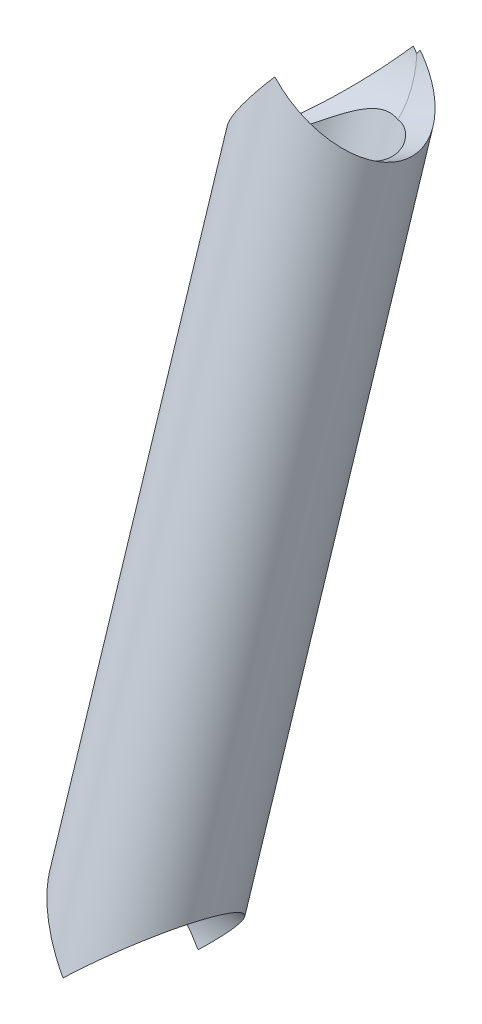
ISO-10303-21;
HEADER;
FILE_DESCRIPTION(('STEP AP214'),'2;1');
FILE_NAME('part.step','',(''),(''),'','','');
FILE_SCHEMA(('AUTOMOTIVE_DESIGN { 1 0 10303 214 1 1 1 1 }'));
ENDSEC;
DATA;
#1=APPLICATION_CONTEXT('core data for automotive mechanical design processes');
#2=APPLICATION_PROTOCOL_DEFINITION('international standard','automotive_design',2000,#1);
#3=PRODUCT_CONTEXT('',#1,'mechanical');
#4=PRODUCT('Part','Part','',(#3));
#5=PRODUCT_RELATED_PRODUCT_CATEGORY('part','',(#4));
#6=PRODUCT_DEFINITION_FORMATION('','',#4);
#7=PRODUCT_DEFINITION_CONTEXT('part definition',#1,'design');
#8=PRODUCT_DEFINITION('design','',#6,#7);
#9=PRODUCT_DEFINITION_SHAPE('','',#8);
#10=(LENGTH_UNIT() NAMED_UNIT(*) SI_UNIT(.MILLI.,.METRE.));
#11=(NAMED_UNIT(*) PLANE_ANGLE_UNIT() SI_UNIT($,.RADIAN.));
#12=(NAMED_UNIT(*) SI_UNIT($,.STERADIAN.) SOLID_ANGLE_UNIT());
#13=UNCERTAINTY_MEASURE_WITH_UNIT(LENGTH_MEASURE(1.E-05),#10,'distance_accuracy_value','');
#14=(GEOMETRIC_REPRESENTATION_CONTEXT(3) GLOBAL_UNCERTAINTY_ASSIGNED_CONTEXT((#13)) GLOBAL_UNIT_ASSIGNED_CONTEXT((#10,
#11,#12)) REPRESENTATION_CONTEXT('',''));
#15=CARTESIAN_POINT('',(0.,0.,0.));
#16=DIRECTION('',(0.,0.,1.));
#17=DIRECTION('',(1.,0.,0.));
#18=AXIS2_PLACEMENT_3D('',#15,#16,#17);
#19=CARTESIAN_POINT('',(549.763263321792,0.,-200.000000000003));
#20=DIRECTION('',(0.,0.952725352528927,-0.303832853142369));
#21=DIRECTION('',(0.,0.303832853142369,0.952725352528927));
#22=AXIS2_PLACEMENT_3D('',#19,#20,#21);
#23=CYLINDRICAL_SURFACE('',#22,9.65000000000002);
#24=CARTESIAN_POINT('',(548.720894557651,115.317466106993,-226.706224291465));
#25=CARTESIAN_POINT('',(548.904218856141,115.400067795765,-226.711627767979));
#26=CARTESIAN_POINT('',(549.090716723595,115.475636342496,-226.720070470305));
#27=CARTESIAN_POINT('',(549.468858186625,115.611517807793,-226.743508663642));
#28=CARTESIAN_POINT('',(549.660503754448,115.671824784224,-226.758506700813));
#29=CARTESIAN_POINT('',(550.045923532026,115.775478212561,-226.795366608986));
#30=CARTESIAN_POINT('',(550.239665074277,115.818966613044,-226.817168096451));
#31=CARTESIAN_POINT('',(550.629148648254,115.889257505975,-226.868087930455));
#32=CARTESIAN_POINT('',(550.824890154707,115.916064270745,-226.897204400876));
#33=CARTESIAN_POINT('',(551.21710952155,115.953286044602,-226.963182381835));
#34=CARTESIAN_POINT('',(551.413588014036,115.96366095575,-227.000062590444));
#35=CARTESIAN_POINT('',(551.805088275734,115.968795082221,-227.081789210122));
#36=CARTESIAN_POINT('',(552.000109849862,115.963552242583,-227.12663666878));
#37=CARTESIAN_POINT('',(552.387470210609,115.938807438365,-227.224553708154));
#38=CARTESIAN_POINT('',(552.579804178785,115.919282557546,-227.277636394718));
#39=CARTESIAN_POINT('',(552.960273802841,115.867597275244,-227.39209938375));
#40=CARTESIAN_POINT('',(553.148408388739,115.83543369146,-227.453481773446));
#41=CARTESIAN_POINT('',(553.571181873634,115.749718659436,-227.602890159303));
#42=CARTESIAN_POINT('',(553.804183298553,115.692705562643,-227.693575859938));
#43=CARTESIAN_POINT('',(554.260243674154,115.564322014848,-227.888750156296));
#44=CARTESIAN_POINT('',(554.483299816071,115.492947538863,-227.993242618739));
#45=CARTESIAN_POINT('',(554.918585934714,115.338886376735,-228.216196016558));
#46=CARTESIAN_POINT('',(555.130802757188,115.25618637405,-228.334673372373));
#47=CARTESIAN_POINT('',(555.543187163795,115.082289555155,-228.585474761989));
#48=CARTESIAN_POINT('',(555.743355608304,114.991093346847,-228.717797805216));
#49=CARTESIAN_POINT('',(556.133860803505,114.801097441472,-228.998404793694));
#50=CARTESIAN_POINT('',(556.323993514547,114.702200747913,-229.146906959589));
#51=CARTESIAN_POINT('',(556.690076463765,114.500276761813,-229.457925538267));
#52=CARTESIAN_POINT('',(556.866026603345,114.397249440563,-229.62044204846));
#53=CARTESIAN_POINT('',(557.202731235622,114.189052527578,-229.959077057864));
#54=CARTESIAN_POINT('',(557.363493327626,114.083884039534,-230.135188673778));
#55=CARTESIAN_POINT('',(557.668960352611,113.873094393251,-230.500593727241));
#56=CARTESIAN_POINT('',(557.813664698912,113.767473218619,-230.689887646002));
#57=CARTESIAN_POINT('',(558.095834337163,113.549803683165,-231.095050413982));
#58=CARTESIAN_POINT('',(558.232030306234,113.437839468452,-231.311851407108));
#59=CARTESIAN_POINT('',(558.483653477465,113.216994628302,-231.758703968249));
#60=CARTESIAN_POINT('',(558.599079547547,113.108114171219,-231.988756257634));
#61=CARTESIAN_POINT('',(558.808040531037,112.895058087504,-232.460658122718));
#62=CARTESIAN_POINT('',(558.901577837694,112.790881947523,-232.702506405183));
#63=CARTESIAN_POINT('',(559.065816052654,112.588644333667,-233.196296752561));
#64=CARTESIAN_POINT('',(559.136518730024,112.490582386583,-233.448238033839));
#65=CARTESIAN_POINT('',(559.250544968897,112.30787524579,-233.943671601414));
#66=CARTESIAN_POINT('',(559.295343258697,112.222772513669,-234.186656859003));
#67=CARTESIAN_POINT('',(559.363929897506,112.059742319891,-234.67793669536));
#68=CARTESIAN_POINT('',(559.387719146475,111.981814551009,-234.926231046236));
#69=CARTESIAN_POINT('',(559.414114512161,111.833717927697,-235.426185149803));
#70=CARTESIAN_POINT('',(559.416724266355,111.763547742981,-235.677844317164));
#71=CARTESIAN_POINT('',(559.400825326342,111.631292976862,-236.182611305406));
#72=CARTESIAN_POINT('',(559.382316738599,111.569208354699,-236.435719118978));
#73=CARTESIAN_POINT('',(559.325356742906,111.455045282838,-236.933494337542));
#74=CARTESIAN_POINT('',(559.28754781019,111.402714425266,-237.178177913705));
#75=CARTESIAN_POINT('',(559.192774110657,111.305614703238,-237.665310532685));
#76=CARTESIAN_POINT('',(559.135809895518,111.260845621058,-237.907759639649));
#77=CARTESIAN_POINT('',(559.003263835808,111.178539653446,-238.388725202246));
#78=CARTESIAN_POINT('',(558.927684031316,111.14100197633,-238.627242085756));
#79=CARTESIAN_POINT('',(558.758519040256,111.072609749441,-239.098783515483));
#80=CARTESIAN_POINT('',(558.664933131486,111.041755467838,-239.331807840978));
#81=CARTESIAN_POINT('',(558.455710696084,110.984700180769,-239.801413966584));
#82=CARTESIAN_POINT('',(558.339257614994,110.958778655176,-240.037665993259));
#83=CARTESIAN_POINT('',(558.088150198072,110.912329378819,-240.500841660434));
#84=CARTESIAN_POINT('',(557.953495244523,110.89180181118,-240.727764984004));
#85=CARTESIAN_POINT('',(557.66649340616,110.854736713348,-241.171047068993));
#86=CARTESIAN_POINT('',(557.514115809989,110.838206267004,-241.387386540024));
#87=CARTESIAN_POINT('',(557.192599897249,110.80750501869,-241.807418471113));
#88=CARTESIAN_POINT('',(557.023461153897,110.793334276829,-242.011110608921));
#89=CARTESIAN_POINT('',(556.65812244567,110.764470297927,-242.416334485832));
#90=CARTESIAN_POINT('',(556.460893460215,110.749799423836,-242.616942957495));
#91=CARTESIAN_POINT('',(556.049263376281,110.717969469392,-242.999627429385));
#92=CARTESIAN_POINT('',(555.834858784316,110.700809882262,-243.181699642183));
#93=CARTESIAN_POINT('',(555.390851937206,110.660687206243,-243.524069266201));
#94=CARTESIAN_POINT('',(555.161300402914,110.637742826025,-243.684434359047));
#95=CARTESIAN_POINT('',(554.68824398864,110.582270506854,-243.981044407543));
#96=CARTESIAN_POINT('',(554.44474843815,110.549748916727,-244.117305246656));
#97=CARTESIAN_POINT('',(554.026997687505,110.484010003277,-244.323081997036));
#98=CARTESIAN_POINT('',(553.855766292114,110.454406597092,-244.399944236016));
#99=CARTESIAN_POINT('',(553.509312661071,110.388042799328,-244.540397952941));
#100=CARTESIAN_POINT('',(553.334091540256,110.351284385896,-244.603993088803));
#101=CARTESIAN_POINT('',(552.981106435739,110.269837826712,-244.717234218293));
#102=CARTESIAN_POINT('',(552.803344007572,110.22515435563,-244.766888390772));
#103=CARTESIAN_POINT('',(552.446769519872,110.127448223914,-244.851951683149));
#104=CARTESIAN_POINT('',(552.267957694131,110.07442735757,-244.887363862247));
#105=CARTESIAN_POINT('',(551.854730039719,109.942060862894,-244.952867054076));
#106=CARTESIAN_POINT('',(551.620441986809,109.859671670836,-244.977816508592));
#107=CARTESIAN_POINT('',(551.271994032701,109.726119582195,-244.997711548328));
#108=CARTESIAN_POINT('',(551.15631238937,109.679927532934,-245.00142038812));
#109=CARTESIAN_POINT('',(550.926190339932,109.584447951588,-245.003241315008));
#110=CARTESIAN_POINT('',(550.811749898647,109.535160507506,-245.001353561144));
#111=CARTESIAN_POINT('',(550.698039428663,109.484435551709,-244.996794368462));
#112=B_SPLINE_CURVE_WITH_KNOTS('',3,(#24,#25,#26,#27,#28,#29,#30,#31,#32,#33,#34,#35,#36,#37,
#38,#39,#40,#41,#42,#43,#44,#45,#46,#47,#48,#49,#50,#51,#52,#53,#54,#55,#56,#57,#58,#59,#60,#61,
#62,#63,#64,#65,#66,#67,#68,#69,#70,#71,#72,#73,#74,#75,#76,#77,#78,#79,#80,#81,#82,#83,#84,#85,
#86,#87,#88,#89,#90,#91,#92,#93,#94,#95,#96,#97,#98,#99,#100,#101,#102,#103,#104,#105,#106,#107,
#108,#109,#110,#111),.UNSPECIFIED.,.F.,.F.,(4,2,2,2,2,2,2,2,2,2,2,2,2,2,2,2,2,2,2,2,2,2,2,2,2,2,
2,2,2,2,2,2,2,2,2,2,2,2,2,2,2,2,2,4),(0.,0.603401911009862,1.2070383980778,1.8054628204255,
2.40373391754963,3.0034627125778,3.60327042257874,4.20404267070272,4.80496628437951,
5.57321395701334,6.34167724277562,7.11105197133343,7.88037169345789,8.6617860814401,
9.44320590124445,10.2242326454028,11.0052879154717,11.8425224944076,12.6798026935905,
13.5169913043677,14.3541150400883,15.1371105115044,15.9200724402839,16.7028998962531,
17.4857234057298,18.2440396320007,19.0023340204597,19.7605453445101,20.5187870857545,
21.3119222678832,22.1050843734456,22.8996420142944,23.6942198918684,24.5382447312516,
25.3824416817,26.2239426625357,27.0648870550076,27.6343517263143,28.2036591805511,
28.7726319335983,29.3414824051641,30.088522450766,30.4622367941762,30.8359405176496),.UNSPECIFIED.);
#113=CARTESIAN_POINT('',(552.000788998512,115.961111324297,-227.128263209481));
#114=VERTEX_POINT('',#113);
#115=CARTESIAN_POINT('',(552.9506630298,110.261122917529,-244.723648048153));
#116=VERTEX_POINT('',#115);
#117=EDGE_CURVE('E121',#114,#116,#112,.T.);
#118=ORIENTED_EDGE('',*,*,#117,.T.);
#119=CARTESIAN_POINT('',(549.763263321791,115.839837306432,-226.813549370293));
#120=CARTESIAN_POINT('',(549.963454600101,115.883889960353,-226.827598901403));
#121=CARTESIAN_POINT('',(550.165307901029,115.919265125789,-226.84543045096));
#122=CARTESIAN_POINT('',(550.570552825057,115.971769590148,-226.888880425677));
#123=CARTESIAN_POINT('',(550.773944438699,115.98889900116,-226.914498802998));
#124=CARTESIAN_POINT('',(551.180423033905,116.00487762994,-226.973691346003));
#125=CARTESIAN_POINT('',(551.383509708001,116.003714212572,-227.007270994889));
#126=CARTESIAN_POINT('',(551.78731677027,115.983894969948,-227.082446634744));
#127=CARTESIAN_POINT('',(551.988036999281,115.965237974828,-227.124043161686));
#128=CARTESIAN_POINT('',(552.383703703848,115.912155124445,-227.21486570198));
#129=CARTESIAN_POINT('',(552.578685512267,115.87786996689,-227.264021101649));
#130=CARTESIAN_POINT('',(552.963528778639,115.795400300772,-227.370218956944));
#131=CARTESIAN_POINT('',(553.15338755417,115.747208659481,-227.427265452128));
#132=CARTESIAN_POINT('',(553.714229729974,115.584613583957,-227.610371328329));
#133=CARTESIAN_POINT('',(554.076285238991,115.452219450728,-227.748353108137));
#134=CARTESIAN_POINT('',(554.666278688279,115.199606309753,-228.009317599273));
#135=CARTESIAN_POINT('',(554.901654910871,115.087820768964,-228.1242097691));
#136=CARTESIAN_POINT('',(555.358004067128,114.852278060427,-228.369614330178));
#137=CARTESIAN_POINT('',(555.578972330569,114.728517042898,-228.50013174773));
#138=CARTESIAN_POINT('',(556.005820845145,114.472536937547,-228.776987879255));
#139=CARTESIAN_POINT('',(556.211689075403,114.340311264658,-228.923338973612));
#140=CARTESIAN_POINT('',(556.607410978176,114.070538262874,-229.231883038767));
#141=CARTESIAN_POINT('',(556.797266232798,113.932991461678,-229.394074441094));
#142=CARTESIAN_POINT('',(557.161993188241,113.653789514853,-229.736107487884));
#143=CARTESIAN_POINT('',(557.33668667909,113.512106399287,-229.91611654158));
#144=CARTESIAN_POINT('',(557.667738161876,113.228549336517,-230.292173448894));
#145=CARTESIAN_POINT('',(557.824095656841,113.086675384246,-230.48822173699));
#146=CARTESIAN_POINT('',(558.117116334748,112.805196429755,-230.895796762118));
#147=CARTESIAN_POINT('',(558.253793105133,112.665589921759,-231.107312666809));
#148=CARTESIAN_POINT('',(558.506224741362,112.390795583312,-231.545198054997));
#149=CARTESIAN_POINT('',(558.621980840241,112.25560749283,-231.771566662022));
#150=CARTESIAN_POINT('',(558.828082916248,111.995733241854,-232.231065121709));
#151=CARTESIAN_POINT('',(558.919084636022,111.870854002945,-232.463791022093));
#152=CARTESIAN_POINT('',(559.078946387723,111.629113028953,-232.940756918349));
#153=CARTESIAN_POINT('',(559.147806588627,111.512251232689,-233.184996826332));
#154=CARTESIAN_POINT('',(559.262355117917,111.288305109391,-233.68302337019));
#155=CARTESIAN_POINT('',(559.308057990582,111.181214680059,-233.936803906072));
#156=CARTESIAN_POINT('',(559.375637075683,110.978193805091,-234.451880738061));
#157=CARTESIAN_POINT('',(559.397516112612,110.882262037719,-234.713176139454));
#158=CARTESIAN_POINT('',(559.415953366757,110.713251402332,-235.209843955839));
#159=CARTESIAN_POINT('',(559.415182232548,110.638811816022,-235.444659168691));
#160=CARTESIAN_POINT('',(559.394828533205,110.500075319563,-235.916444055124));
#161=CARTESIAN_POINT('',(559.375247702843,110.435777474702,-236.153413528025));
#162=CARTESIAN_POINT('',(559.317527538015,110.317646380224,-236.627669572427));
#163=CARTESIAN_POINT('',(559.279389686439,110.263812294931,-236.86495611708));
#164=CARTESIAN_POINT('',(559.185022271189,110.166672340728,-237.338077744273));
#165=CARTESIAN_POINT('',(559.128792367891,110.123366669486,-237.573912799482));
#166=CARTESIAN_POINT('',(559.000371600792,110.047988673896,-238.037058102751));
#167=CARTESIAN_POINT('',(558.928574897406,110.015682231711,-238.264439996486));
#168=CARTESIAN_POINT('',(558.769042116874,109.960599330567,-238.714701417271));
#169=CARTESIAN_POINT('',(558.681306482388,109.937822607004,-238.937581069169));
#170=CARTESIAN_POINT('',(558.490685437883,109.901255503708,-239.37748153717));
#171=CARTESIAN_POINT('',(558.387801531829,109.88746423261,-239.594502932371));
#172=CARTESIAN_POINT('',(558.167668513581,109.868157279481,-240.021525279686));
#173=CARTESIAN_POINT('',(558.050417781108,109.862642531801,-240.231525436545));
#174=CARTESIAN_POINT('',(557.791350551531,109.858884508637,-240.661638606254));
#175=CARTESIAN_POINT('',(557.648278285844,109.861328028067,-240.88100158135));
#176=CARTESIAN_POINT('',(557.346974508564,109.873745772368,-241.308827171311));
#177=CARTESIAN_POINT('',(557.188742149097,109.883720418654,-241.517289175497));
#178=CARTESIAN_POINT('',(556.857648324523,109.909760188047,-241.922474940223));
#179=CARTESIAN_POINT('',(556.68476089202,109.925836305296,-242.11917676529));
#180=CARTESIAN_POINT('',(556.325318993715,109.962395672578,-242.499227581227));
#181=CARTESIAN_POINT('',(556.138764223731,109.982879020718,-242.682576274726));
#182=CARTESIAN_POINT('',(555.730287647053,110.028840266535,-243.054975455856));
#183=CARTESIAN_POINT('',(555.506768715833,110.054621750049,-243.242242952612));
#184=CARTESIAN_POINT('',(555.044138173576,110.10617290857,-243.596613158348));
#185=CARTESIAN_POINT('',(554.805022261514,110.13194257833,-243.76371026862));
#186=CARTESIAN_POINT('',(554.312644914729,110.179727479908,-244.074886662474));
#187=CARTESIAN_POINT('',(554.059418715353,110.201751552286,-244.219020093842));
#188=CARTESIAN_POINT('',(553.539565934703,110.237859946411,-244.481774207648));
#189=CARTESIAN_POINT('',(553.272949122395,110.251949967284,-244.600413165096));
#190=CARTESIAN_POINT('',(552.82475545525,110.264807637222,-244.772051292517));
#191=CARTESIAN_POINT('',(552.646463192947,110.267232533807,-244.833423586529));
#192=CARTESIAN_POINT('',(552.286004325276,110.265613195542,-244.943296749823));
#193=CARTESIAN_POINT('',(552.103838996274,110.261571060265,-244.991801790602));
#194=CARTESIAN_POINT('',(551.737025438188,110.245952371541,-245.075115121048));
#195=CARTESIAN_POINT('',(551.552381914303,110.234388535555,-245.109946370834));
#196=CARTESIAN_POINT('',(551.18166738084,110.202944342803,-245.165497182829));
#197=CARTESIAN_POINT('',(550.995596353771,110.183063883977,-245.186216571854));
#198=CARTESIAN_POINT('',(550.623061856764,110.134534420129,-245.213388123659));
#199=CARTESIAN_POINT('',(550.436598614484,110.105862900213,-245.219803298646));
#200=CARTESIAN_POINT('',(550.06527837995,110.039850593487,-245.21847354642));
#201=CARTESIAN_POINT('',(549.880421369629,110.00250990431,-245.210728778672));
#202=CARTESIAN_POINT('',(549.513439215619,109.919639504578,-245.181657574523));
#203=CARTESIAN_POINT('',(549.331317298807,109.874100836067,-245.160316215667));
#204=CARTESIAN_POINT('',(548.971006729789,109.77572427649,-245.104908695374));
#205=CARTESIAN_POINT('',(548.792819228332,109.722884281873,-245.07083886196));
#206=CARTESIAN_POINT('',(548.379848438895,109.591483199184,-244.977075792995));
#207=CARTESIAN_POINT('',(548.14696030223,109.510372153257,-244.912591288417));
#208=CARTESIAN_POINT('',(547.690474654815,109.339615080569,-244.764837874695));
#209=CARTESIAN_POINT('',(547.466880860141,109.249965686255,-244.681561536113));
#210=CARTESIAN_POINT('',(547.028522828362,109.06454792148,-244.498210144745));
#211=CARTESIAN_POINT('',(546.813785620312,108.968762813103,-244.398087813407));
#212=CARTESIAN_POINT('',(546.393587795437,108.77368362757,-244.1830438484));
#213=CARTESIAN_POINT('',(546.188127232082,108.674389530193,-244.068122129443));
#214=CARTESIAN_POINT('',(545.690426062327,108.426762375357,-243.767024950499));
#215=CARTESIAN_POINT('',(545.40337636696,108.277561769773,-243.572952213934));
#216=CARTESIAN_POINT('',(544.84736330793,107.981518243479,-243.158696408367));
#217=CARTESIAN_POINT('',(544.578409130547,107.83467654865,-242.938500232079));
#218=CARTESIAN_POINT('',(544.058219571467,107.548184497985,-242.4739774467));
#219=CARTESIAN_POINT('',(543.806979909308,107.408532407099,-242.229656701457));
#220=CARTESIAN_POINT('',(543.322465974214,107.140843347098,-241.718061468082));
#221=CARTESIAN_POINT('',(543.08918423473,107.012801546669,-241.450796618495));
#222=CARTESIAN_POINT('',(542.693159774843,106.800361943329,-240.958166958416));
#223=CARTESIAN_POINT('',(542.526539305417,106.712701765123,-240.737315833079));
#224=CARTESIAN_POINT('',(542.205438016534,106.548983165198,-240.282790322052));
#225=CARTESIAN_POINT('',(542.050957207785,106.472924753714,-240.04911592505));
#226=CARTESIAN_POINT('',(541.755654889494,106.334814284679,-239.569893178909));
#227=CARTESIAN_POINT('',(541.614809450214,106.272737426108,-239.324366808193));
#228=CARTESIAN_POINT('',(541.348105636227,106.16485177385,-238.821889310708));
#229=CARTESIAN_POINT('',(541.222241438682,106.119036645817,-238.564942676396));
#230=CARTESIAN_POINT('',(541.015760298077,106.054967790516,-238.104095826185));
#231=CARTESIAN_POINT('',(540.931552718788,106.032731468081,-237.902351808023));
#232=CARTESIAN_POINT('',(540.773866289387,106.000169570103,-237.493865819135));
#233=CARTESIAN_POINT('',(540.700381304538,105.98983716043,-237.287126785765));
#234=CARTESIAN_POINT('',(540.565117055795,105.982106166717,-236.869635283107));
#235=CARTESIAN_POINT('',(540.503335380578,105.984704915354,-236.658883650436));
#236=CARTESIAN_POINT('',(540.392467147529,106.003738286721,-236.234649929569));
#237=CARTESIAN_POINT('',(540.343380721978,106.020173053609,-236.021167812946));
#238=CARTESIAN_POINT('',(540.258482834334,106.067758517971,-235.591329679495));
#239=CARTESIAN_POINT('',(540.222783944749,106.099029209038,-235.374964469994));
#240=CARTESIAN_POINT('',(540.166002506341,106.176704442977,-234.943013655888));
#241=CARTESIAN_POINT('',(540.14491990515,106.223108931627,-234.727428048493));
#242=CARTESIAN_POINT('',(540.117866654352,106.330987923525,-234.299204337146));
#243=CARTESIAN_POINT('',(540.111888466099,106.392454892245,-234.086564815522));
#244=CARTESIAN_POINT('',(540.115168413286,106.529994387398,-233.66619602716));
#245=CARTESIAN_POINT('',(540.124425184089,106.606065605151,-233.458466322327));
#246=CARTESIAN_POINT('',(540.155876129219,106.761682974538,-233.075033272105));
#247=CARTESIAN_POINT('',(540.176334833759,106.839644809719,-232.898538611375));
#248=CARTESIAN_POINT('',(540.228430356501,107.005322575432,-232.551816412019));
#249=CARTESIAN_POINT('',(540.260071275487,107.093042076236,-232.381591197871));
#250=CARTESIAN_POINT('',(540.33401280702,107.277264266507,-232.048372152904));
#251=CARTESIAN_POINT('',(540.376313758546,107.373767235219,-231.885378552237));
#252=CARTESIAN_POINT('',(540.470948023296,107.574539435634,-231.567264084298));
#253=CARTESIAN_POINT('',(540.52328343646,107.678810290147,-231.412144873531));
#254=CARTESIAN_POINT('',(540.654223571682,107.926017339516,-231.065438233975));
#255=CARTESIAN_POINT('',(540.736015832671,108.07124924089,-230.876679365451));
#256=CARTESIAN_POINT('',(540.913767351945,108.370772657738,-230.513657739932));
#257=CARTESIAN_POINT('',(541.009730174824,108.525066446825,-230.339398647637));
#258=CARTESIAN_POINT('',(541.316961370929,108.998881749874,-229.838018875786));
#259=CARTESIAN_POINT('',(541.547484400737,109.329172448065,-229.53252050527));
#260=CARTESIAN_POINT('',(541.970244419687,109.896996021477,-229.0648599527));
#261=CARTESIAN_POINT('',(542.151611865376,110.130914106451,-228.887885726399));
#262=CARTESIAN_POINT('',(542.531680084086,110.601944055406,-228.558091704291));
#263=CARTESIAN_POINT('',(542.730387632223,110.839057136861,-228.405281415973));
#264=CARTESIAN_POINT('',(543.144092194266,111.313663761727,-228.122050055522));
#265=CARTESIAN_POINT('',(543.359131232113,111.551156633658,-227.991689772175));
#266=CARTESIAN_POINT('',(543.804211273162,112.022745112708,-227.752374659736));
#267=CARTESIAN_POINT('',(544.034250127506,112.256841200597,-227.643416773496));
#268=CARTESIAN_POINT('',(544.516198841489,112.725230465522,-227.442699392178));
#269=CARTESIAN_POINT('',(544.768554530637,112.959324373092,-227.351544429995));
#270=CARTESIAN_POINT('',(545.28948826406,113.416459094705,-227.189480823447));
#271=CARTESIAN_POINT('',(545.558072199017,113.639495840981,-227.118579585112));
#272=CARTESIAN_POINT('',(546.111342556937,114.06857947729,-226.996624932811));
#273=CARTESIAN_POINT('',(546.395969488808,114.274682964221,-226.945503089807));
#274=CARTESIAN_POINT('',(546.982858672243,114.663981505232,-226.862652822574));
#275=CARTESIAN_POINT('',(547.28510327782,114.847198922968,-226.830905346441));
#276=CARTESIAN_POINT('',(547.937928888575,115.198509593399,-226.785104801782));
#277=CARTESIAN_POINT('',(548.290374491198,115.363514697195,-226.773018185146));
#278=CARTESIAN_POINT('',(548.833304491108,115.572916581952,-226.773755650444));
#279=CARTESIAN_POINT('',(549.016574484542,115.636346746171,-226.777140415498));
#280=CARTESIAN_POINT('',(549.387159273422,115.749031964829,-226.790413989237));
#281=CARTESIAN_POINT('',(549.574472237792,115.798293297337,-226.800299910924));
#282=CARTESIAN_POINT('',(549.763263321791,115.839837306432,-226.813549370293));
#283=B_SPLINE_CURVE_WITH_KNOTS('',3,(#119,#120,#121,#122,#123,#124,#125,#126,#127,#128,#129,
#130,#131,#132,#133,#134,#135,#136,#137,#138,#139,#140,#141,#142,#143,#144,#145,#146,#147,#148,
#149,#150,#151,#152,#153,#154,#155,#156,#157,#158,#159,#160,#161,#162,#163,#164,#165,#166,#167,
#168,#169,#170,#171,#172,#173,#174,#175,#176,#177,#178,#179,#180,#181,#182,#183,#184,#185,#186,
#187,#188,#189,#190,#191,#192,#193,#194,#195,#196,#197,#198,#199,#200,#201,#202,#203,#204,#205,
#206,#207,#208,#209,#210,#211,#212,#213,#214,#215,#216,#217,#218,#219,#220,#221,#222,#223,#224,
#225,#226,#227,#228,#229,#230,#231,#232,#233,#234,#235,#236,#237,#238,#239,#240,#241,#242,#243,
#244,#245,#246,#247,#248,#249,#250,#251,#252,#253,#254,#255,#256,#257,#258,#259,#260,#261,#262,
#263,#264,#265,#266,#267,#268,#269,#270,#271,#272,#273,#274,#275,#276,#277,#278,#279,#280,#281,
#282),.UNSPECIFIED.,.T.,.F.,(4,2,2,2,2,2,2,2,2,2,2,2,2,2,2,2,2,2,2,2,2,2,2,2,2,2,2,2,2,2,2,2,2,
2,2,2,2,2,2,2,2,2,2,2,2,2,2,2,2,2,2,2,2,2,2,2,2,2,2,2,2,2,2,2,2,2,2,2,2,2,2,2,2,2,2,2,2,2,2,2,2,
4),(0.,0.616169531446551,1.23233527751846,1.84892663732313,2.46555923395663,3.07674681127599,
3.68824842967281,4.9118476711775,5.76528018930667,6.61898797946932,7.4733681768952,
8.32766386111553,9.19092744856172,10.0542144282019,10.9169025128607,11.7795397352606,
12.6164089643079,13.4532718065049,14.2896083919567,15.1258458126808,15.8639281070356,
16.601942336399,17.3398976008158,18.0778667189188,18.7989695164121,19.5200522902495,
20.2410635210504,20.9621561419182,21.7470721693635,22.5320321211616,23.3184132468745,
24.1048118797396,24.981945750924,25.859322531624,26.7345988414682,27.6092456251649,
28.1744582525344,28.7394874163606,29.3035637207211,29.867646947465,30.4331870956101,
30.9987208748308,31.5648764073111,32.1311953936488,32.8946879732714,33.6584829336764,
34.4244583888085,35.1904382584321,36.3206425205574,37.4514162736853,38.5819158483368,
39.7119428159565,40.5818909940018,41.4518399394449,42.3202333645849,43.1882881568141,
43.8469375740089,44.5052086666951,45.1633439827494,45.8214861560416,46.4850445960518,
47.1486006586477,47.8118254734789,48.4749908847161,49.0564072482481,49.6380370527118,
50.219685354828,50.8014555132845,51.5557677532982,52.3102700642069,53.8201407029628,
54.8536123698258,55.8874896578553,56.9241238432,57.9606098463806,59.0277756588972,
60.0953311960606,61.1591596562789,62.2219403014195,63.3856386186769,63.9669774304113,
64.548058258465),.UNSPECIFIED.);
#284=EDGE_CURVE('E99',#116,#114,#283,.T.);
#285=ORIENTED_EDGE('',*,*,#284,.T.);
#286=EDGE_LOOP('',(#118,#285));
#287=FACE_BOUND('',#286,.T.);
#288=CARTESIAN_POINT('',(549.763263321792,10.7980316524196,-193.314754123196));
#289=CARTESIAN_POINT('',(549.539382373851,10.7980359503274,-193.314758148168));
#290=CARTESIAN_POINT('',(549.315467333173,10.8043843902808,-193.324981828378));
#291=CARTESIAN_POINT('',(548.870141430403,10.8292943093365,-193.365474756838));
#292=CARTESIAN_POINT('',(548.648731172298,10.8478586728404,-193.395748739339));
#293=CARTESIAN_POINT('',(548.209954175848,10.8959122956714,-193.475335692931));
#294=CARTESIAN_POINT('',(547.992600772256,10.9254325652742,-193.524702723028));
#295=CARTESIAN_POINT('',(547.564056959246,10.993496999595,-193.640947789629));
#296=CARTESIAN_POINT('',(547.352869013885,11.0320447181234,-193.707832723586));
#297=CARTESIAN_POINT('',(546.894798854645,11.1247229489481,-193.872909936388));
#298=CARTESIAN_POINT('',(546.649541296661,11.1804276108316,-193.974714339344));
#299=CARTESIAN_POINT('',(546.170197428192,11.2983006755458,-194.198757233975));
#300=CARTESIAN_POINT('',(545.936114353463,11.3604709342301,-194.32100159879));
#301=CARTESIAN_POINT('',(545.479183708734,11.4881012895441,-194.583830653371));
#302=CARTESIAN_POINT('',(545.256346440831,11.5535642968163,-194.724431751245));
#303=CARTESIAN_POINT('',(544.822200053089,11.6849247343547,-195.022147962735));
#304=CARTESIAN_POINT('',(544.610889940417,11.7508221266577,-195.1792616507));
#305=CARTESIAN_POINT('',(544.194956599263,11.8821738162686,-195.512595644783));
#306=CARTESIAN_POINT('',(543.99061114852,11.9475804685051,-195.689180952437));
#307=CARTESIAN_POINT('',(543.594262008463,12.0740157082447,-196.057158215868));
#308=CARTESIAN_POINT('',(543.402258713889,12.1350441557266,-196.248550644791));
#309=CARTESIAN_POINT('',(543.031188721572,12.2505871337697,-196.645044728327));
#310=CARTESIAN_POINT('',(542.852111874308,12.3051067973523,-196.850135378365));
#311=CARTESIAN_POINT('',(542.5074199282,12.4057391048896,-197.273292934266));
#312=CARTESIAN_POINT('',(542.341804195639,12.451852144735,-197.491359228431));
#313=CARTESIAN_POINT('',(542.031624071378,12.5320945611029,-197.930158672029));
#314=CARTESIAN_POINT('',(541.886467779546,12.5666457831263,-198.150395467832));
#315=CARTESIAN_POINT('',(541.610421834211,12.6247549995391,-198.601016129438));
#316=CARTESIAN_POINT('',(541.479530072154,12.6483146203779,-198.831398488456));
#317=CARTESIAN_POINT('',(541.233196878124,12.6829497303191,-199.301238024062));
#318=CARTESIAN_POINT('',(541.117756291125,12.6940245369142,-199.540695696031));
#319=CARTESIAN_POINT('',(540.903679522185,12.7023010444596,-200.02727772481));
#320=CARTESIAN_POINT('',(540.805043207601,12.6995028549222,-200.274402021086));
#321=CARTESIAN_POINT('',(540.625138819322,12.6787305659371,-200.776917901035));
#322=CARTESIAN_POINT('',(540.544041143913,12.6606153027505,-201.032365062104));
#323=CARTESIAN_POINT('',(540.401776604971,12.6080635270223,-201.547144619501));
#324=CARTESIAN_POINT('',(540.340610036994,12.5736267724704,-201.806477073384));
#325=CARTESIAN_POINT('',(540.239458867492,12.4879133983539,-202.326222329657));
#326=CARTESIAN_POINT('',(540.199452060889,12.4366545238774,-202.586633709339));
#327=CARTESIAN_POINT('',(540.141391793292,12.3172111699944,-203.106004802347));
#328=CARTESIAN_POINT('',(540.123334337241,12.2490297734203,-203.364964771303));
#329=CARTESIAN_POINT('',(540.110619452727,12.1079596528952,-203.839113252516));
#330=CARTESIAN_POINT('',(540.112795475944,12.0374001807844,-204.05491876697));
#331=CARTESIAN_POINT('',(540.133110055638,11.8850836306192,-204.481753201535));
#332=CARTESIAN_POINT('',(540.151246665384,11.8033279192098,-204.692782700961));
#333=CARTESIAN_POINT('',(540.203188628911,11.6294340067203,-205.108526830703));
#334=CARTESIAN_POINT('',(540.236994006435,11.5372957899079,-205.313241451449));
#335=CARTESIAN_POINT('',(540.319754189133,11.3436431209831,-205.71502380454));
#336=CARTESIAN_POINT('',(540.368709401114,11.2421284171428,-205.912091331383));
#337=CARTESIAN_POINT('',(540.479291544734,11.0342161115687,-206.291372197167));
#338=CARTESIAN_POINT('',(540.540468143557,10.9280749104633,-206.473858299346));
#339=CARTESIAN_POINT('',(540.675661666447,10.709138459686,-206.829938060453));
#340=CARTESIAN_POINT('',(540.749683005688,10.5963409308352,-207.003528635021));
#341=CARTESIAN_POINT('',(540.909745174143,10.3652835985041,-207.341167147563));
#342=CARTESIAN_POINT('',(540.995782447911,10.2470254177029,-207.505217888055));
#343=CARTESIAN_POINT('',(541.179138877269,10.0060900152288,-207.823556207455));
#344=CARTESIAN_POINT('',(541.276462073465,9.88341122178204,-207.977840258924));
#345=CARTESIAN_POINT('',(541.495117119764,9.61839885104585,-208.296066936392));
#346=CARTESIAN_POINT('',(541.617923149338,9.47560223255335,-208.45861132851));
#347=CARTESIAN_POINT('',(541.876052067138,9.18726233322964,-208.770941370736));
#348=CARTESIAN_POINT('',(542.011380274376,9.04171790630677,-208.920721546651));
#349=CARTESIAN_POINT('',(542.293800682274,8.74927343385782,-209.207726461129));
#350=CARTESIAN_POINT('',(542.440904355349,8.60237219275439,-209.344938669182));
#351=CARTESIAN_POINT('',(542.746012680418,8.30887144066894,-209.606837996102));
#352=CARTESIAN_POINT('',(542.90401451053,8.16227186162633,-209.731528336896));
#353=CARTESIAN_POINT('',(543.263803932328,7.84101243186079,-209.992983290086));
#354=CARTESIAN_POINT('',(543.467939883753,7.66674225752277,-210.127005962383));
#355=CARTESIAN_POINT('',(543.890709042672,7.3234700169349,-210.377957728859));
#356=CARTESIAN_POINT('',(544.109345734111,7.15446923114988,-210.494882693364));
#357=CARTESIAN_POINT('',(544.560790617385,6.82486936753471,-210.712146621109));
#358=CARTESIAN_POINT('',(544.793598481996,6.66427009586611,-210.812485967124));
#359=CARTESIAN_POINT('',(545.273099502033,6.35525582950894,-210.996960258655));
#360=CARTESIAN_POINT('',(545.519787597186,6.20683644233309,-211.081101060792));
#361=CARTESIAN_POINT('',(546.139558181119,5.86443427404189,-211.267260595695));
#362=CARTESIAN_POINT('',(546.520355678168,5.67926841068887,-211.36076959648));
#363=CARTESIAN_POINT('',(547.111370178834,5.44014349916222,-211.476181903222));
#364=CARTESIAN_POINT('',(547.311530037012,5.36691054608758,-211.51049535723));
#365=CARTESIAN_POINT('',(547.71802508628,5.23556256044366,-211.570829648789));
#366=CARTESIAN_POINT('',(547.9243590543,5.17744455547653,-211.596852117012));
#367=CARTESIAN_POINT('',(548.308943754439,5.08644714947147,-211.637015368843));
#368=CARTESIAN_POINT('',(548.486466801228,5.05102834360673,-211.652385198815));
#369=CARTESIAN_POINT('',(548.844083331729,4.99367388827295,-211.6770802282));
#370=CARTESIAN_POINT('',(549.024176268884,4.97173541431588,-211.68640669388));
#371=CARTESIAN_POINT('',(549.385636804092,4.94213802075017,-211.698954400371));
#372=CARTESIAN_POINT('',(549.567003516644,4.93447000953571,-211.702179528322));
#373=CARTESIAN_POINT('',(549.929779697881,4.93367764954937,-211.702513629407));
#374=CARTESIAN_POINT('',(550.111189167497,4.94055365327458,-211.699622454304));
#375=CARTESIAN_POINT('',(550.472352023541,4.96856116933237,-211.687755411739));
#376=CARTESIAN_POINT('',(550.652107865324,4.98966610411859,-211.678790888244));
#377=CARTESIAN_POINT('',(551.009095827152,5.04534005035633,-211.654846879805));
#378=CARTESIAN_POINT('',(551.186327942937,5.07990908453145,-211.639867384709));
#379=CARTESIAN_POINT('',(551.537533118818,5.16143422741692,-211.603946569771));
#380=CARTESIAN_POINT('',(551.71150154078,5.20840671710235,-211.582997362941));
#381=CARTESIAN_POINT('',(552.055268276707,5.31338409370249,-211.535218790955));
#382=CARTESIAN_POINT('',(552.225065407578,5.37139207071303,-211.508387778487));
#383=CARTESIAN_POINT('',(552.638785919913,5.52659240981508,-211.434911753501));
#384=CARTESIAN_POINT('',(552.880019719958,5.62938374784898,-211.384882444006));
#385=CARTESIAN_POINT('',(553.351705987995,5.85154242436447,-211.272309222734));
#386=CARTESIAN_POINT('',(553.582153259685,5.97091764429449,-211.209759354324));
#387=CARTESIAN_POINT('',(554.032373356822,6.22272093775999,-211.071963608516));
#388=CARTESIAN_POINT('',(554.252126582628,6.35517172316179,-210.996695472621));
#389=CARTESIAN_POINT('',(554.680440547356,6.62977974528093,-210.833353436548));
#390=CARTESIAN_POINT('',(554.889002696555,6.77193575380999,-210.745281155137));
#391=CARTESIAN_POINT('',(555.302719431692,7.06893276745287,-210.552380766736));
#392=CARTESIAN_POINT('',(555.507434747137,7.22405133884894,-210.447038650288));
#393=CARTESIAN_POINT('',(555.904566712812,7.53939570236285,-210.221793717926));
#394=CARTESIAN_POINT('',(556.09698268149,7.6996217767708,-210.101890096169));
#395=CARTESIAN_POINT('',(556.468902631432,8.02277520691607,-209.847200938676));
#396=CARTESIAN_POINT('',(556.648418518758,8.18569989650674,-209.712429424239));
#397=CARTESIAN_POINT('',(556.994122010467,8.51236694117446,-209.427439015515));
#398=CARTESIAN_POINT('',(557.160305248247,8.6761095456279,-209.277215096847));
#399=CARTESIAN_POINT('',(557.472240971025,8.99606035369596,-208.967085024386));
#400=CARTESIAN_POINT('',(557.618532858205,9.15231649016803,-208.807771929293));
#401=CARTESIAN_POINT('',(557.896819020558,9.46181173199091,-208.474422101933));
#402=CARTESIAN_POINT('',(558.028815440998,9.61505128719677,-208.300387585855));
#403=CARTESIAN_POINT('',(558.277241975126,9.91656324779641,-207.937716789679));
#404=CARTESIAN_POINT('',(558.393681326996,10.0648385615229,-207.74908928131));
#405=CARTESIAN_POINT('',(558.609723551994,10.3545537759347,-207.357479375401));
#406=CARTESIAN_POINT('',(558.709329222126,10.4959948093775,-207.154499370569));
#407=CARTESIAN_POINT('',(558.876790122569,10.7495783517817,-206.766241097642));
#408=CARTESIAN_POINT('',(558.947165454003,10.8629422138365,-206.58284490416));
#409=CARTESIAN_POINT('',(559.073879364138,11.0820478390466,-206.206893622742));
#410=CARTESIAN_POINT('',(559.130220370021,11.1877909179357,-206.014340125395));
#411=CARTESIAN_POINT('',(559.228095725714,11.3904431405009,-205.621094840326));
#412=CARTESIAN_POINT('',(559.269636652375,11.4873561937729,-205.420406711735));
#413=CARTESIAN_POINT('',(559.337333870418,11.6713233876207,-205.012021579241));
#414=CARTESIAN_POINT('',(559.363489986274,11.7583774157046,-204.8043244954));
#415=CARTESIAN_POINT('',(559.4000548803,11.9219353984604,-204.382774361722));
#416=CARTESIAN_POINT('',(559.410418981188,11.9984088667167,-204.168905584377));
#417=CARTESIAN_POINT('',(559.415088147956,12.1398045290546,-203.737209394564));
#418=CARTESIAN_POINT('',(559.40939318231,12.2047267004597,-203.519381974324));
#419=CARTESIAN_POINT('',(559.382036923811,12.3225783908328,-203.081474407353));
#420=CARTESIAN_POINT('',(559.36037366755,12.3755064339971,-202.861393986882));
#421=CARTESIAN_POINT('',(559.301426956767,12.4691908704997,-202.420747231221));
#422=CARTESIAN_POINT('',(559.264143703867,12.5099474209357,-202.200180902339));
#423=CARTESIAN_POINT('',(559.17640268031,12.5779418627715,-201.769440871793));
#424=CARTESIAN_POINT('',(559.126561550913,12.6056741212663,-201.559218538045));
#425=CARTESIAN_POINT('',(559.013681955235,12.6503778700016,-201.141121777947));
#426=CARTESIAN_POINT('',(558.950638918525,12.667345625409,-200.933248191058));
#427=CARTESIAN_POINT('',(558.812110319348,12.6909799237586,-200.521167617258));
#428=CARTESIAN_POINT('',(558.736627843011,12.697649017475,-200.316959734815));
#429=CARTESIAN_POINT('',(558.573946719229,12.7013089696485,-199.913112383384));
#430=CARTESIAN_POINT('',(558.486743808722,12.698296297389,-199.713474607743));
#431=CARTESIAN_POINT('',(558.29171219845,12.682512524679,-199.29912140804));
#432=CARTESIAN_POINT('',(558.182680414841,12.6687546951478,-199.085010091917));
#433=CARTESIAN_POINT('',(557.952199695961,12.6313400164827,-198.664388299887));
#434=CARTESIAN_POINT('',(557.83074556563,12.6076790129197,-198.457881053524));
#435=CARTESIAN_POINT('',(557.576274815346,12.551570909467,-198.053259052875));
#436=CARTESIAN_POINT('',(557.443253543939,12.5191202638331,-197.855147722883));
#437=CARTESIAN_POINT('',(557.166428366809,12.4466070924358,-197.468052348237));
#438=CARTESIAN_POINT('',(557.022623116445,12.4065436164793,-197.279069446641));
#439=CARTESIAN_POINT('',(556.695228518772,12.311409095327,-196.874202999671));
#440=CARTESIAN_POINT('',(556.509414435306,12.2549379621585,-196.660443121741));
#441=CARTESIAN_POINT('',(556.123941212174,12.1349735746569,-196.247856431192));
#442=CARTESIAN_POINT('',(555.924279505439,12.0714790170191,-196.049032401683));
#443=CARTESIAN_POINT('',(555.511491507022,11.9397778499039,-195.667276170013));
#444=CARTESIAN_POINT('',(555.298356347665,11.8715681342828,-195.484354626313));
#445=CARTESIAN_POINT('',(554.859012000491,11.7330817486638,-195.135853055989));
#446=CARTESIAN_POINT('',(554.632805396264,11.6628054884609,-194.970269620532));
#447=CARTESIAN_POINT('',(554.208609527986,11.5355269701892,-194.685733026335));
#448=CARTESIAN_POINT('',(554.012717782552,11.4783780537113,-194.563715066068));
#449=CARTESIAN_POINT('',(553.61213001864,11.3665905239026,-194.333699167808));
#450=CARTESIAN_POINT('',(553.407433857385,11.31195195131,-194.225701457285));
#451=CARTESIAN_POINT('',(552.989763355926,11.2074343116952,-194.025373385186));
#452=CARTESIAN_POINT('',(552.776804071788,11.1575471121446,-193.933016034471));
#453=CARTESIAN_POINT('',(552.342758894803,11.064821271247,-193.765506679212));
#454=CARTESIAN_POINT('',(552.121676551405,11.0219795950681,-193.690347261237));
#455=CARTESIAN_POINT('',(551.725209076613,10.9547780244514,-193.574565704276));
#456=CARTESIAN_POINT('',(551.551314026575,10.9284414053978,-193.529978257721));
#457=CARTESIAN_POINT('',(551.200087254933,10.8823909389951,-193.45281803132));
#458=CARTESIAN_POINT('',(551.022757504163,10.862673406106,-193.420238564378));
#459=CARTESIAN_POINT('',(550.665715101342,10.8307470915285,-193.367815814456));
#460=CARTESIAN_POINT('',(550.486004943991,10.8185309998946,-193.347960131678));
#461=CARTESIAN_POINT('',(550.125291518549,10.8021724934009,-193.321429210766));
#462=CARTESIAN_POINT('',(549.944288565063,10.7980281772253,-193.314750868691));
#463=CARTESIAN_POINT('',(549.763263321792,10.7980316524196,-193.314754123196));
#464=B_SPLINE_CURVE_WITH_KNOTS('',3,(#288,#289,#290,#291,#292,#293,#294,#295,#296,#297,#298,
#299,#300,#301,#302,#303,#304,#305,#306,#307,#308,#309,#310,#311,#312,#313,#314,#315,#316,#317,
#318,#319,#320,#321,#322,#323,#324,#325,#326,#327,#328,#329,#330,#331,#332,#333,#334,#335,#336,
#337,#338,#339,#340,#341,#342,#343,#344,#345,#346,#347,#348,#349,#350,#351,#352,#353,#354,#355,
#356,#357,#358,#359,#360,#361,#362,#363,#364,#365,#366,#367,#368,#369,#370,#371,#372,#373,#374,
#375,#376,#377,#378,#379,#380,#381,#382,#383,#384,#385,#386,#387,#388,#389,#390,#391,#392,#393,
#394,#395,#396,#397,#398,#399,#400,#401,#402,#403,#404,#405,#406,#407,#408,#409,#410,#411,#412,
#413,#414,#415,#416,#417,#418,#419,#420,#421,#422,#423,#424,#425,#426,#427,#428,#429,#430,#431,
#432,#433,#434,#435,#436,#437,#438,#439,#440,#441,#442,#443,#444,#445,#446,#447,#448,#449,#450,
#451,#452,#453,#454,#455,#456,#457,#458,#459,#460,#461,#462,#463),.UNSPECIFIED.,.T.,.F.,(4,2,2,
2,2,2,2,2,2,2,2,2,2,2,2,2,2,2,2,2,2,2,2,2,2,2,2,2,2,2,2,2,2,2,2,2,2,2,2,2,2,2,2,2,2,2,2,2,2,2,2,
2,2,2,2,2,2,2,2,2,2,2,2,2,2,2,2,2,2,2,2,2,2,2,2,2,2,2,2,2,2,2,2,2,2,2,2,4),(0.,
0.671388216053427,1.3429350159763,2.01639728297759,2.69012511695789,3.50284680113881,
4.31580241225212,5.12948972081745,5.94310683548749,6.77603626888394,7.60899232867268,
8.44128709329763,9.27354265277041,10.070856300488,10.8680519306423,11.6652911389631,
12.4625240539582,13.2671854568248,14.0718587913485,14.8756860168625,15.679366913825,
16.3596774651138,17.039905049645,17.7201336649134,18.4003805473888,19.0590875510847,
19.718021424909,20.376760735458,21.0357366214717,21.7813767458618,22.5273350605274,
23.2740291938512,24.0205307047472,24.9196255407811,25.8189371811316,26.718228063543,
27.6171931921709,28.9130820785534,29.5601152219662,30.2070210280809,30.7514736990663,
31.2958122538041,31.8398038956168,32.3838087220744,32.9268002325263,33.4697926593983,
34.0135058227383,34.5573714583076,35.3569857878303,36.1569814404226,36.9583919646087,
37.759701258249,38.5918172217672,39.4239792560908,40.2553631149299,41.0870181596353,
41.8867475795096,42.6863568202145,43.4854891019668,44.2844884728417,44.9641894144936,
45.643772722745,46.3230536604038,47.0023423479024,47.6835492700304,48.3647575294259,
49.0460495618416,49.7273328004133,50.3801047969011,51.0331031543242,51.6859397510574,
52.339014449257,53.0603263298708,53.7819411080611,54.5038474205442,55.2258438968049,
56.0914127625261,56.9571425182012,57.8234481166131,58.689583070229,59.4023259760518,
60.1150804442801,60.8265921595314,61.5377965865478,62.0816281586099,62.6251564183501,
63.1681541809218,63.7110240242855),.UNSPECIFIED.);
#465=CARTESIAN_POINT('',(549.763263321792,10.7980316524196,-193.314754123196));
#466=VERTEX_POINT('',#465);
#467=EDGE_CURVE('E102',#466,#466,#464,.T.);
#468=ORIENTED_EDGE('',*,*,#467,.T.);
#469=EDGE_LOOP('',(#468));
#470=FACE_BOUND('',#469,.T.);
#471=ADVANCED_FACE('F42',(#287,#470),#23,.F.);
#472=CARTESIAN_POINT('',(549.763263321792,0.,-200.000000000003));
#473=DIRECTION('',(0.,0.952725352528927,-0.303832853142369));
#474=DIRECTION('',(0.,0.303832853142369,0.952725352528927));
#475=AXIS2_PLACEMENT_3D('',#472,#473,#474);
#476=CYLINDRICAL_SURFACE('',#475,12.7);
#477=CARTESIAN_POINT('',(549.763263321791,120.981001464975,-238.581950982575));
#478=DIRECTION('',(0.622473225849887,0.745642012843662,-0.23779207678661));
#479=DIRECTION('',(-0.782641094691581,0.593046023537652,-0.189127816214705));
#480=AXIS2_PLACEMENT_3D('',#477,#478,#479);
#481=ELLIPSE('',#480,16.2271059955071,12.7);
#482=CARTESIAN_POINT('',(550.617566225778,116.483716605107,-250.447711561629));
#483=VERTEX_POINT('',#482);
#484=CARTESIAN_POINT('',(549.763263321791,117.122324230067,-250.681562959692));
#485=VERTEX_POINT('',#484);
#486=EDGE_CURVE('E95',#483,#485,#481,.T.);
#487=ORIENTED_EDGE('',*,*,#486,.F.);
#488=CARTESIAN_POINT('',(549.763263321791,120.981001464975,-238.581950982575));
#489=DIRECTION('',(-0.830309146632101,0.498688630759052,-0.248789812031631));
#490=DIRECTION('',(0.54780642250779,0.812381728131507,-0.19986007919863));
#491=AXIS2_PLACEMENT_3D('',#488,#489,#490);
#492=ELLIPSE('',#491,23.0613980502635,12.7);
#493=CARTESIAN_POINT('',(551.064306543941,117.142625744603,-250.617903722735));
#494=VERTEX_POINT('',#493);
#495=EDGE_CURVE('E83',#494,#483,#492,.T.);
#496=ORIENTED_EDGE('',*,*,#495,.F.);
#497=CARTESIAN_POINT('',(549.763263321791,120.981001464975,-238.581950982575));
#498=DIRECTION('',(0.54780642250779,0.812381728131507,-0.19986007919863));
#499=DIRECTION('',(-0.830309146632101,0.498688630759052,-0.248789812031631));
#500=AXIS2_PLACEMENT_3D('',#497,#498,#499);
#501=ELLIPSE('',#500,15.2150340812043,12.7);
#502=CARTESIAN_POINT('',(549.31497522409,124.30028318532,-226.318627907238));
#503=VERTEX_POINT('',#502);
#504=EDGE_CURVE('E81',#503,#494,#501,.T.);
#505=ORIENTED_EDGE('',*,*,#504,.F.);
#506=CARTESIAN_POINT('',(549.763263321791,120.981001464975,-238.581950982575));
#507=DIRECTION('',(-0.782641094691581,0.593046023537652,-0.189127816214705));
#508=DIRECTION('',(0.622473225849887,0.745642012843662,-0.23779207678661));
#509=AXIS2_PLACEMENT_3D('',#506,#507,#508);
#510=ELLIPSE('',#509,20.4024839504705,12.7);
#511=EDGE_CURVE('E107',#485,#503,#510,.T.);
#512=ORIENTED_EDGE('',*,*,#511,.F.);
#513=EDGE_LOOP('',(#487,#496,#505,#512));
#514=FACE_BOUND('',#513,.T.);
#515=CARTESIAN_POINT('',(549.763263321792,-3.05311331771918E-13,-200.000000000002));
#516=DIRECTION('',(0.707106781186547,0.67367855738155,-0.214842270804223));
#517=DIRECTION('',(-0.707106781186548,0.673678557381547,-0.214842270804227));
#518=AXIS2_PLACEMENT_3D('',#515,#516,#517);
#519=ELLIPSE('',#518,17.9605122421383,12.7);
#520=CARTESIAN_POINT('',(549.763263321792,3.85867723490623,-187.900388022883));
#521=VERTEX_POINT('',#520);
#522=CARTESIAN_POINT('',(549.763263321792,-3.85867723490756,-212.099611977119));
#523=VERTEX_POINT('',#522);
#524=EDGE_CURVE('E53',#521,#523,#519,.F.);
#525=ORIENTED_EDGE('',*,*,#524,.F.);
#526=CARTESIAN_POINT('',(549.763263321792,-3.05311331771918E-13,-200.000000000002));
#527=DIRECTION('',(-0.707106781186548,0.673678557381547,-0.214842270804227));
#528=DIRECTION('',(0.707106781186547,0.67367855738155,-0.214842270804223));
#529=AXIS2_PLACEMENT_3D('',#526,#527,#528);
#530=ELLIPSE('',#529,17.9605122421383,12.7);
#531=EDGE_CURVE('E11',#523,#521,#530,.F.);
#532=ORIENTED_EDGE('',*,*,#531,.F.);
#533=EDGE_LOOP('',(#525,#532));
#534=FACE_BOUND('',#533,.T.);
#535=ADVANCED_FACE('F105',(#514,#534),#476,.T.);
#536=CARTESIAN_POINT('',(-4.44089209850063E-13,0.,-200.000000000003));
#537=DIRECTION('',(0.974346253790711,0.214414809831064,-0.0683788494281436));
#538=DIRECTION('',(-0.214917840654067,0.97663213226301,0.));
#539=AXIS2_PLACEMENT_3D('',#536,#537,#538);
#540=CYLINDRICAL_SURFACE('',#539,12.7);
#541=CARTESIAN_POINT('',(549.763263321791,120.981001464975,-238.581950982575));
#542=DIRECTION('',(0.949282258198056,0.310528416732901,-0.0493487251279848));
#543=DIRECTION('',(0.296210008732079,-0.93584957532468,-0.190906267816323));
#544=AXIS2_PLACEMENT_3D('',#541,#542,#543);
#545=ELLIPSE('',#544,12.7652827726635,12.7);
#546=EDGE_CURVE('E86',#116,#483,#545,.T.);
#547=ORIENTED_EDGE('',*,*,#546,.T.);
#548=ORIENTED_EDGE('',*,*,#486,.T.);
#549=ORIENTED_EDGE('',*,*,#511,.T.);
#550=EDGE_CURVE('E104',#503,#114,#545,.T.);
#551=ORIENTED_EDGE('',*,*,#550,.T.);
#552=ORIENTED_EDGE('',*,*,#284,.F.);
#553=EDGE_LOOP('',(#547,#548,#549,#551,#552));
#554=FACE_BOUND('',#553,.T.);
#555=ADVANCED_FACE('F93',(#554),#540,.F.);
#556=CARTESIAN_POINT('',(900.,275.499546279119,-249.999999999998));
#557=DIRECTION('',(-0.914508837603376,-0.403465884665263,0.0298138534342737));
#558=DIRECTION('',(0.40364531781772,-0.914915546596423,0.));
#559=AXIS2_PLACEMENT_3D('',#556,#557,#558);
#560=CYLINDRICAL_SURFACE('',#559,12.7);
#561=ORIENTED_EDGE('',*,*,#550,.F.);
#562=ORIENTED_EDGE('',*,*,#504,.T.);
#563=ORIENTED_EDGE('',*,*,#495,.T.);
#564=ORIENTED_EDGE('',*,*,#546,.F.);
#565=ORIENTED_EDGE('',*,*,#117,.F.);
#566=EDGE_LOOP('',(#561,#562,#563,#564,#565));
#567=FACE_BOUND('',#566,.T.);
#568=ADVANCED_FACE('F85',(#567),#560,.F.);
#569=CARTESIAN_POINT('',(-5.55111512312578E-13,0.,-200.000000000003));
#570=DIRECTION('',(1.,0.,0.));
#571=DIRECTION('',(0.,0.,-1.));
#572=AXIS2_PLACEMENT_3D('',#569,#570,#571);
#573=CYLINDRICAL_SURFACE('',#572,12.7);
#574=ORIENTED_EDGE('',*,*,#467,.F.);
#575=EDGE_LOOP('',(#574));
#576=FACE_BOUND('',#575,.T.);
#577=ORIENTED_EDGE('',*,*,#524,.T.);
#578=ORIENTED_EDGE('',*,*,#531,.T.);
#579=EDGE_LOOP('',(#577,#578));
#580=FACE_BOUND('',#579,.T.);
#581=ADVANCED_FACE('F44',(#576,#580),#573,.F.);
#582=CLOSED_SHELL('',(#471,#535,#555,#568,#581));
#583=MANIFOLD_SOLID_BREP('B2',#582);
#584=ADVANCED_BREP_SHAPE_REPRESENTATION('',(#18,#583),#14);
#585=SHAPE_DEFINITION_REPRESENTATION(#9,#584);
ENDSEC;
END-ISO-10303-21;
